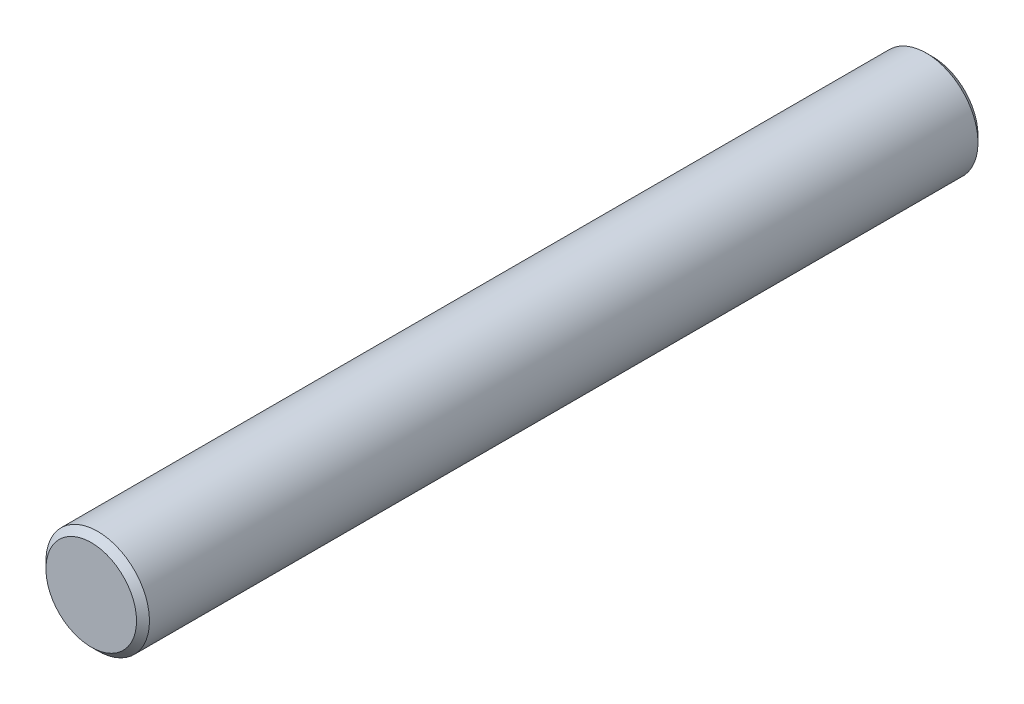
ISO-10303-21;
HEADER;
FILE_DESCRIPTION(('STEP AP214'),'2;1');
FILE_NAME('part.step','',(''),(''),'','','');
FILE_SCHEMA(('AUTOMOTIVE_DESIGN { 1 0 10303 214 1 1 1 1 }'));
ENDSEC;
DATA;
#1=APPLICATION_CONTEXT('core data for automotive mechanical design processes');
#2=APPLICATION_PROTOCOL_DEFINITION('international standard','automotive_design',2000,#1);
#3=PRODUCT_CONTEXT('',#1,'mechanical');
#4=PRODUCT('Part','Part','',(#3));
#5=PRODUCT_RELATED_PRODUCT_CATEGORY('part','',(#4));
#6=PRODUCT_DEFINITION_FORMATION('','',#4);
#7=PRODUCT_DEFINITION_CONTEXT('part definition',#1,'design');
#8=PRODUCT_DEFINITION('design','',#6,#7);
#9=PRODUCT_DEFINITION_SHAPE('','',#8);
#10=(LENGTH_UNIT() NAMED_UNIT(*) SI_UNIT(.MILLI.,.METRE.));
#11=(NAMED_UNIT(*) PLANE_ANGLE_UNIT() SI_UNIT($,.RADIAN.));
#12=(NAMED_UNIT(*) SI_UNIT($,.STERADIAN.) SOLID_ANGLE_UNIT());
#13=UNCERTAINTY_MEASURE_WITH_UNIT(LENGTH_MEASURE(1.E-05),#10,'distance_accuracy_value','');
#14=(GEOMETRIC_REPRESENTATION_CONTEXT(3) GLOBAL_UNCERTAINTY_ASSIGNED_CONTEXT((#13)) GLOBAL_UNIT_ASSIGNED_CONTEXT((#10,
#11,#12)) REPRESENTATION_CONTEXT('',''));
#15=CARTESIAN_POINT('',(0.,0.,0.));
#16=DIRECTION('',(0.,0.,1.));
#17=DIRECTION('',(1.,0.,0.));
#18=AXIS2_PLACEMENT_3D('',#15,#16,#17);
#19=CARTESIAN_POINT('',(0.,0.,65.));
#20=DIRECTION('',(0.,0.,-1.));
#21=DIRECTION('',(-1.,0.,0.));
#22=AXIS2_PLACEMENT_3D('',#19,#20,#21);
#23=CYLINDRICAL_SURFACE('',#22,4.);
#24=CARTESIAN_POINT('',(0.,0.,64.5));
#25=DIRECTION('',(0.,0.,1.));
#26=DIRECTION('',(1.,0.,0.));
#27=AXIS2_PLACEMENT_3D('',#24,#25,#26);
#28=CIRCLE('',#27,4.);
#29=CARTESIAN_POINT('',(4.,0.,64.5));
#30=VERTEX_POINT('',#29);
#31=EDGE_CURVE('E40',#30,#30,#28,.F.);
#32=ORIENTED_EDGE('',*,*,#31,.T.);
#33=EDGE_LOOP('',(#32));
#34=FACE_BOUND('',#33,.T.);
#35=CARTESIAN_POINT('',(0.,0.,0.5));
#36=DIRECTION('',(0.,0.,1.));
#37=DIRECTION('',(1.,0.,0.));
#38=AXIS2_PLACEMENT_3D('',#35,#36,#37);
#39=CIRCLE('',#38,4.);
#40=CARTESIAN_POINT('',(4.,0.,0.5));
#41=VERTEX_POINT('',#40);
#42=EDGE_CURVE('E44',#41,#41,#39,.T.);
#43=ORIENTED_EDGE('',*,*,#42,.T.);
#44=EDGE_LOOP('',(#43));
#45=FACE_BOUND('',#44,.T.);
#46=ADVANCED_FACE('F33',(#34,#45),#23,.T.);
#47=CARTESIAN_POINT('',(0.,0.,65.));
#48=DIRECTION('',(0.,0.,1.));
#49=DIRECTION('',(1.,0.,0.));
#50=AXIS2_PLACEMENT_3D('',#47,#48,#49);
#51=PLANE('',#50);
#52=CARTESIAN_POINT('',(0.,0.,65.));
#53=DIRECTION('',(0.,0.,1.));
#54=DIRECTION('',(1.,0.,0.));
#55=AXIS2_PLACEMENT_3D('',#52,#53,#54);
#56=CIRCLE('',#55,3.49999999999999);
#57=CARTESIAN_POINT('',(3.49999999999999,0.,65.));
#58=VERTEX_POINT('',#57);
#59=EDGE_CURVE('E48',#58,#58,#56,.T.);
#60=ORIENTED_EDGE('',*,*,#59,.T.);
#61=EDGE_LOOP('',(#60));
#62=FACE_BOUND('',#61,.T.);
#63=ADVANCED_FACE('F54',(#62),#51,.T.);
#64=CARTESIAN_POINT('',(0.,0.,0.));
#65=DIRECTION('',(0.,0.,1.));
#66=DIRECTION('',(1.,0.,0.));
#67=AXIS2_PLACEMENT_3D('',#64,#65,#66);
#68=PLANE('',#67);
#69=CARTESIAN_POINT('',(0.,0.,0.));
#70=DIRECTION('',(0.,0.,1.));
#71=DIRECTION('',(1.,0.,0.));
#72=AXIS2_PLACEMENT_3D('',#69,#70,#71);
#73=CIRCLE('',#72,3.5);
#74=CARTESIAN_POINT('',(3.5,0.,0.));
#75=VERTEX_POINT('',#74);
#76=EDGE_CURVE('E10',#75,#75,#73,.F.);
#77=ORIENTED_EDGE('',*,*,#76,.T.);
#78=EDGE_LOOP('',(#77));
#79=FACE_BOUND('',#78,.T.);
#80=ADVANCED_FACE('F58',(#79),#68,.F.);
#81=CARTESIAN_POINT('',(0.,0.,65.));
#82=DIRECTION('',(0.,0.,-1.));
#83=DIRECTION('',(-1.,0.,0.));
#84=AXIS2_PLACEMENT_3D('',#81,#82,#83);
#85=CONICAL_SURFACE('',#84,3.49999999999999,0.785398163397445);
#86=ORIENTED_EDGE('',*,*,#31,.F.);
#87=EDGE_LOOP('',(#86));
#88=FACE_BOUND('',#87,.T.);
#89=ORIENTED_EDGE('',*,*,#59,.F.);
#90=EDGE_LOOP('',(#89));
#91=FACE_BOUND('',#90,.T.);
#92=ADVANCED_FACE('F56',(#88,#91),#85,.T.);
#93=CARTESIAN_POINT('',(0.,0.,0.5));
#94=DIRECTION('',(0.,0.,1.));
#95=DIRECTION('',(1.,0.,0.));
#96=AXIS2_PLACEMENT_3D('',#93,#94,#95);
#97=CONICAL_SURFACE('',#96,4.,0.785398163397445);
#98=ORIENTED_EDGE('',*,*,#76,.F.);
#99=EDGE_LOOP('',(#98));
#100=FACE_BOUND('',#99,.T.);
#101=ORIENTED_EDGE('',*,*,#42,.F.);
#102=EDGE_LOOP('',(#101));
#103=FACE_BOUND('',#102,.T.);
#104=ADVANCED_FACE('F35',(#100,#103),#97,.T.);
#105=CLOSED_SHELL('',(#46,#63,#80,#92,#104));
#106=MANIFOLD_SOLID_BREP('B2',#105);
#107=ADVANCED_BREP_SHAPE_REPRESENTATION('',(#18,#106),#14);
#108=SHAPE_DEFINITION_REPRESENTATION(#9,#107);
ENDSEC;
END-ISO-10303-21;
